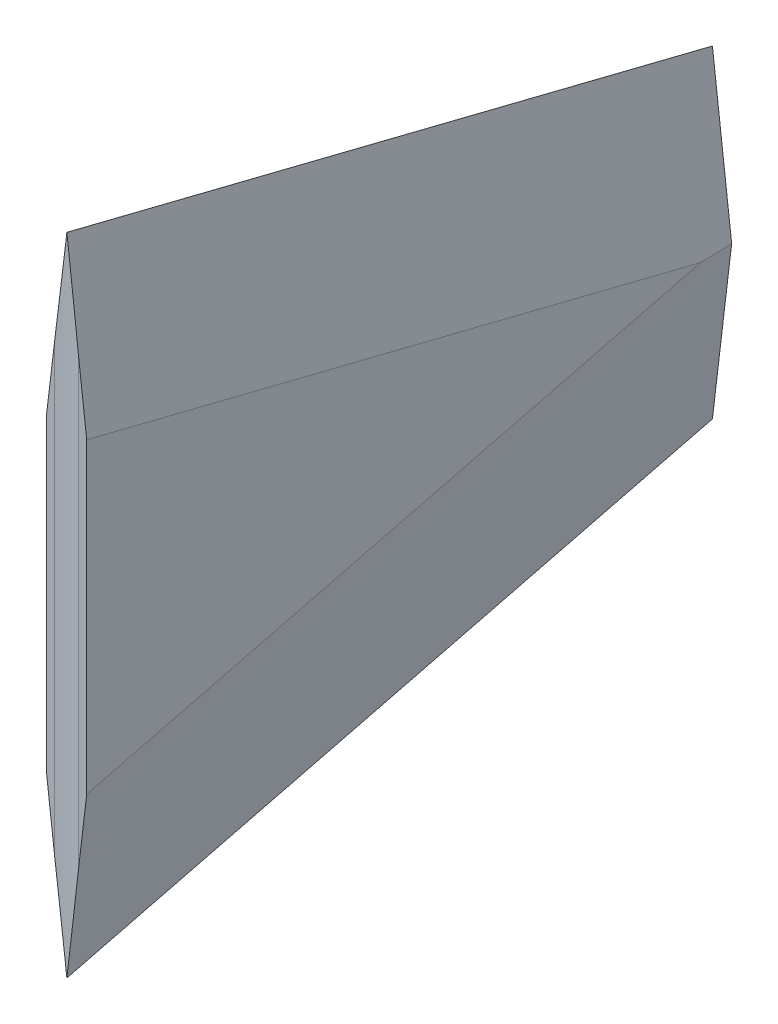
ISO-10303-21;
HEADER;
FILE_DESCRIPTION(('STEP AP214'),'2;1');
FILE_NAME('part.step','',(''),(''),'','','');
FILE_SCHEMA(('AUTOMOTIVE_DESIGN { 1 0 10303 214 1 1 1 1 }'));
ENDSEC;
DATA;
#1=APPLICATION_CONTEXT('core data for automotive mechanical design processes');
#2=APPLICATION_PROTOCOL_DEFINITION('international standard','automotive_design',2000,#1);
#3=PRODUCT_CONTEXT('',#1,'mechanical');
#4=PRODUCT('Part','Part','',(#3));
#5=PRODUCT_RELATED_PRODUCT_CATEGORY('part','',(#4));
#6=PRODUCT_DEFINITION_FORMATION('','',#4);
#7=PRODUCT_DEFINITION_CONTEXT('part definition',#1,'design');
#8=PRODUCT_DEFINITION('design','',#6,#7);
#9=PRODUCT_DEFINITION_SHAPE('','',#8);
#10=(LENGTH_UNIT() NAMED_UNIT(*) SI_UNIT(.MILLI.,.METRE.));
#11=(NAMED_UNIT(*) PLANE_ANGLE_UNIT() SI_UNIT($,.RADIAN.));
#12=(NAMED_UNIT(*) SI_UNIT($,.STERADIAN.) SOLID_ANGLE_UNIT());
#13=UNCERTAINTY_MEASURE_WITH_UNIT(LENGTH_MEASURE(1.E-05),#10,'distance_accuracy_value','');
#14=(GEOMETRIC_REPRESENTATION_CONTEXT(3) GLOBAL_UNCERTAINTY_ASSIGNED_CONTEXT((#13)) GLOBAL_UNIT_ASSIGNED_CONTEXT((#10,
#11,#12)) REPRESENTATION_CONTEXT('',''));
#15=CARTESIAN_POINT('',(0.,0.,0.));
#16=DIRECTION('',(0.,0.,1.));
#17=DIRECTION('',(1.,0.,0.));
#18=AXIS2_PLACEMENT_3D('',#15,#16,#17);
#19=CARTESIAN_POINT('',(6.35,0.,0.));
#20=DIRECTION('',(0.,0.,1.));
#21=DIRECTION('',(1.,0.,0.));
#22=AXIS2_PLACEMENT_3D('',#19,#20,#21);
#23=PLANE('',#22);
#24=DIRECTION('',(0.,1.,0.));
#25=VECTOR('',#24,1.);
#26=CARTESIAN_POINT('',(5.03527907583775,-25.4,0.));
#27=LINE('',#26,#25);
#28=CARTESIAN_POINT('',(5.03527907583788,-9.78295689131601,0.));
#29=VERTEX_POINT('',#28);
#30=CARTESIAN_POINT('',(5.03527907583775,60.5829568913172,0.));
#31=VERTEX_POINT('',#30);
#32=EDGE_CURVE('E97',#29,#31,#27,.T.);
#33=ORIENTED_EDGE('',*,*,#32,.F.);
#34=DIRECTION('',(0.118282309764434,0.992980007450699,0.));
#35=VECTOR('',#34,1.);
#36=CARTESIAN_POINT('',(6.202700496062,0.0175460990374543,0.));
#37=LINE('',#36,#35);
#38=CARTESIAN_POINT('',(6.35,1.25412545574038,0.));
#39=VERTEX_POINT('',#38);
#40=EDGE_CURVE('E41',#29,#39,#37,.T.);
#41=ORIENTED_EDGE('',*,*,#40,.T.);
#42=DIRECTION('',(0.,1.,0.));
#43=VECTOR('',#42,1.);
#44=CARTESIAN_POINT('',(6.35,0.,0.));
#45=LINE('',#44,#43);
#46=CARTESIAN_POINT('',(6.35,49.5458745442599,0.));
#47=VERTEX_POINT('',#46);
#48=EDGE_CURVE('E146',#39,#47,#45,.T.);
#49=ORIENTED_EDGE('',*,*,#48,.T.);
#50=DIRECTION('',(0.118282309764435,-0.992980007450699,0.));
#51=VECTOR('',#50,1.);
#52=CARTESIAN_POINT('',(12.1692605126857,0.693181704965604,0.));
#53=LINE('',#52,#51);
#54=EDGE_CURVE('E106',#47,#31,#53,.F.);
#55=ORIENTED_EDGE('',*,*,#54,.T.);
#56=EDGE_LOOP('',(#33,#41,#49,#55));
#57=FACE_BOUND('',#56,.T.);
#58=ADVANCED_FACE('F33',(#57),#23,.T.);
#59=DIRECTION('',(0.,1.,0.));
#60=VECTOR('',#59,1.);
#61=CARTESIAN_POINT('',(1.31472092416225,-25.4,0.));
#62=LINE('',#61,#60);
#63=CARTESIAN_POINT('',(1.31472092416226,60.5829568913173,0.));
#64=VERTEX_POINT('',#63);
#65=CARTESIAN_POINT('',(1.31472092416233,-9.78295689131778,0.));
#66=VERTEX_POINT('',#65);
#67=EDGE_CURVE('E108',#64,#66,#62,.F.);
#68=ORIENTED_EDGE('',*,*,#67,.F.);
#69=DIRECTION('',(-0.118282309764435,-0.992980007450699,0.));
#70=VECTOR('',#69,1.);
#71=CARTESIAN_POINT('',(-5.73041953718531,1.43900170704356,0.));
#72=LINE('',#71,#70);
#73=CARTESIAN_POINT('',(0.,49.5458745442598,0.));
#74=VERTEX_POINT('',#73);
#75=EDGE_CURVE('E136',#64,#74,#72,.T.);
#76=ORIENTED_EDGE('',*,*,#75,.T.);
#77=DIRECTION('',(0.,1.,0.));
#78=VECTOR('',#77,1.);
#79=CARTESIAN_POINT('',(0.,0.,0.));
#80=LINE('',#79,#78);
#81=CARTESIAN_POINT('',(0.,1.2541254557404,0.));
#82=VERTEX_POINT('',#81);
#83=EDGE_CURVE('E147',#82,#74,#80,.T.);
#84=ORIENTED_EDGE('',*,*,#83,.F.);
#85=DIRECTION('',(-0.118282309764434,0.992980007450699,0.));
#86=VECTOR('',#85,1.);
#87=CARTESIAN_POINT('',(0.236140479438385,-0.728273903040497,0.));
#88=LINE('',#87,#86);
#89=EDGE_CURVE('E119',#82,#66,#88,.F.);
#90=ORIENTED_EDGE('',*,*,#89,.T.);
#91=EDGE_LOOP('',(#68,#76,#84,#90));
#92=FACE_BOUND('',#91,.T.);
#93=ADVANCED_FACE('F165',(#92),#23,.T.);
#94=CARTESIAN_POINT('',(6.35,0.,-101.6));
#95=DIRECTION('',(0.,0.,1.));
#96=DIRECTION('',(1.,0.,0.));
#97=AXIS2_PLACEMENT_3D('',#94,#95,#96);
#98=PLANE('',#97);
#99=DIRECTION('',(-0.118282309764435,0.992980007450699,0.));
#100=VECTOR('',#99,1.);
#101=CARTESIAN_POINT('',(0.718181169625556,71.4249944336458,-101.6));
#102=LINE('',#101,#100);
#103=CARTESIAN_POINT('',(3.175,50.8,-101.6));
#104=VERTEX_POINT('',#103);
#105=CARTESIAN_POINT('',(6.20061043069722,25.4000000000004,-101.6));
#106=VERTEX_POINT('',#105);
#107=EDGE_CURVE('E134',#104,#106,#102,.F.);
#108=ORIENTED_EDGE('',*,*,#107,.T.);
#109=DIRECTION('',(-0.118282309764434,-0.992980007450699,0.));
#110=VECTOR('',#109,1.);
#111=CARTESIAN_POINT('',(3.35805531498596,1.53674939558291,-101.6));
#112=LINE('',#111,#110);
#113=CARTESIAN_POINT('',(3.175,0.,-101.6));
#114=VERTEX_POINT('',#113);
#115=EDGE_CURVE('E113',#106,#114,#112,.T.);
#116=ORIENTED_EDGE('',*,*,#115,.T.);
#117=DIRECTION('',(0.118282309764434,-0.992980007450699,0.));
#118=VECTOR('',#117,1.);
#119=CARTESIAN_POINT('',(5.98279294899935,-23.5714222098809,-101.6));
#120=LINE('',#119,#118);
#121=CARTESIAN_POINT('',(0.149389569302784,25.4000000000001,-101.6));
#122=VERTEX_POINT('',#121);
#123=EDGE_CURVE('E126',#114,#122,#120,.F.);
#124=ORIENTED_EDGE('',*,*,#123,.T.);
#125=DIRECTION('',(0.118282309764435,0.992980007450699,0.));
#126=VECTOR('',#125,1.);
#127=CARTESIAN_POINT('',(2.64097056638914,46.3168228281822,-101.6));
#128=LINE('',#127,#126);
#129=EDGE_CURVE('E141',#122,#104,#128,.T.);
#130=ORIENTED_EDGE('',*,*,#129,.T.);
#131=EDGE_LOOP('',(#108,#116,#124,#130));
#132=FACE_BOUND('',#131,.T.);
#133=ADVANCED_FACE('F175',(#132),#98,.F.);
#134=CARTESIAN_POINT('',(6.35,0.,0.));
#135=DIRECTION('',(1.,0.,0.));
#136=DIRECTION('',(0.,0.,-1.));
#137=AXIS2_PLACEMENT_3D('',#134,#135,#136);
#138=PLANE('',#137);
#139=ORIENTED_EDGE('',*,*,#48,.F.);
#140=DIRECTION('',(0.,0.242535625036333,-0.970142500145332));
#141=VECTOR('',#140,1.);
#142=CARTESIAN_POINT('',(6.35,25.0862357230498,-95.3284410692376));
#143=LINE('',#142,#141);
#144=CARTESIAN_POINT('',(6.35,25.4000000000001,-96.5834981770389));
#145=VERTEX_POINT('',#144);
#146=EDGE_CURVE('E112',#39,#145,#143,.T.);
#147=ORIENTED_EDGE('',*,*,#146,.T.);
#148=DIRECTION('',(0.,0.242535625036333,0.970142500145332));
#149=VECTOR('',#148,1.);
#150=CARTESIAN_POINT('',(6.35,46.631411335774,-11.6578528339435));
#151=LINE('',#150,#149);
#152=EDGE_CURVE('E131',#145,#47,#151,.T.);
#153=ORIENTED_EDGE('',*,*,#152,.T.);
#154=EDGE_LOOP('',(#139,#147,#153));
#155=FACE_BOUND('',#154,.T.);
#156=ADVANCED_FACE('F178',(#155),#138,.T.);
#157=CARTESIAN_POINT('',(0.,0.,0.));
#158=DIRECTION('',(1.,0.,0.));
#159=DIRECTION('',(0.,0.,-1.));
#160=AXIS2_PLACEMENT_3D('',#157,#158,#159);
#161=PLANE('',#160);
#162=DIRECTION('',(0.,-0.242535625036333,-0.970142500145332));
#163=VECTOR('',#162,1.);
#164=CARTESIAN_POINT('',(0.,25.7137642769504,-95.3284410692376));
#165=LINE('',#164,#163);
#166=CARTESIAN_POINT('',(0.,25.4000000000001,-96.5834981770389));
#167=VERTEX_POINT('',#166);
#168=EDGE_CURVE('E143',#74,#167,#165,.T.);
#169=ORIENTED_EDGE('',*,*,#168,.T.);
#170=DIRECTION('',(0.,-0.242535625036333,0.970142500145332));
#171=VECTOR('',#170,1.);
#172=CARTESIAN_POINT('',(0.,1.18035337010863,0.295088342527157));
#173=LINE('',#172,#171);
#174=EDGE_CURVE('E122',#167,#82,#173,.T.);
#175=ORIENTED_EDGE('',*,*,#174,.T.);
#176=ORIENTED_EDGE('',*,*,#83,.T.);
#177=EDGE_LOOP('',(#169,#175,#176));
#178=FACE_BOUND('',#177,.T.);
#179=ADVANCED_FACE('F168',(#178),#161,.F.);
#180=CARTESIAN_POINT('',(0.,46.631411335774,-11.6578528339435));
#181=DIRECTION('',(-0.992546151641322,0.118230629502141,-0.0295576573755352));
#182=DIRECTION('',(0.,0.242535625036333,0.970142500145332));
#183=AXIS2_PLACEMENT_3D('',#180,#181,#182);
#184=PLANE('',#183);
#185=CARTESIAN_POINT('',(3.175,84.709,34.036));
#186=DIRECTION('',(-0.992546151641322,0.118230629502141,-0.0295576573755352));
#187=DIRECTION('',(0.118178239324949,0.992986162163163,0.00351930426754921));
#188=AXIS2_PLACEMENT_3D('',#185,#186,#187);
#189=ELLIPSE('',#188,288.307692714964,34.0868);
#190=CARTESIAN_POINT('',(3.175,76.1873,-0.0508000000000002));
#191=VERTEX_POINT('',#190);
#192=EDGE_CURVE('E150',#191,#64,#189,.T.);
#193=ORIENTED_EDGE('',*,*,#192,.F.);
#194=DIRECTION('',(0.,0.242535625036333,0.970142500145332));
#195=VECTOR('',#194,1.);
#196=CARTESIAN_POINT('',(3.175,76.2,0.));
#197=LINE('',#196,#195);
#198=EDGE_CURVE('E138',#104,#191,#197,.T.);
#199=ORIENTED_EDGE('',*,*,#198,.F.);
#200=ORIENTED_EDGE('',*,*,#129,.F.);
#201=DIRECTION('',(0.0297664343188282,0.,-0.999556881516976));
#202=VECTOR('',#201,1.);
#203=CARTESIAN_POINT('',(-2.52681346996779,25.4000000000002,-11.7331004047226));
#204=LINE('',#203,#202);
#205=EDGE_CURVE('E124',#122,#167,#204,.F.);
#206=ORIENTED_EDGE('',*,*,#205,.T.);
#207=ORIENTED_EDGE('',*,*,#168,.F.);
#208=ORIENTED_EDGE('',*,*,#75,.F.);
#209=EDGE_LOOP('',(#193,#199,#200,#206,#207,#208));
#210=FACE_BOUND('',#209,.T.);
#211=ADVANCED_FACE('F170',(#210),#184,.T.);
#212=CARTESIAN_POINT('',(3.17500000000001,71.7176470588235,-17.9294117647059));
#213=DIRECTION('',(-0.992546151641322,-0.118230629502141,0.0295576573755352));
#214=DIRECTION('',(0.,-0.242535625036333,-0.970142500145332));
#215=AXIS2_PLACEMENT_3D('',#212,#213,#214);
#216=PLANE('',#215);
#217=CARTESIAN_POINT('',(3.175,84.709,34.036));
#218=DIRECTION('',(-0.992546151641322,-0.118230629502141,0.0295576573755352));
#219=DIRECTION('',(-0.118178239324949,0.992986162163163,0.0035193042675492));
#220=AXIS2_PLACEMENT_3D('',#217,#218,#219);
#221=ELLIPSE('',#220,288.307692714964,34.0868);
#222=EDGE_CURVE('E107',#31,#191,#221,.F.);
#223=ORIENTED_EDGE('',*,*,#222,.F.);
#224=ORIENTED_EDGE('',*,*,#54,.F.);
#225=ORIENTED_EDGE('',*,*,#152,.F.);
#226=DIRECTION('',(0.0297664343188282,0.,0.999556881516977));
#227=VECTOR('',#226,1.);
#228=CARTESIAN_POINT('',(8.68740106625647,25.4000000000002,-18.093569030102));
#229=LINE('',#228,#227);
#230=EDGE_CURVE('E55',#145,#106,#229,.F.);
#231=ORIENTED_EDGE('',*,*,#230,.T.);
#232=ORIENTED_EDGE('',*,*,#107,.F.);
#233=ORIENTED_EDGE('',*,*,#198,.T.);
#234=EDGE_LOOP('',(#223,#224,#225,#231,#232,#233));
#235=FACE_BOUND('',#234,.T.);
#236=ADVANCED_FACE('F179',(#235),#216,.F.);
#237=CARTESIAN_POINT('',(3.175,-23.9058823529412,-5.97647058823529));
#238=DIRECTION('',(0.992546151641322,0.11823062950214,0.0295576573755349));
#239=DIRECTION('',(0.,0.242535625036333,-0.970142500145332));
#240=AXIS2_PLACEMENT_3D('',#237,#238,#239);
#241=PLANE('',#240);
#242=CARTESIAN_POINT('',(3.175,-33.909,34.036));
#243=DIRECTION('',(0.992546151641322,0.11823062950214,0.0295576573755349));
#244=DIRECTION('',(-0.118178239324948,0.992986162163163,-0.00351930426754914));
#245=AXIS2_PLACEMENT_3D('',#242,#243,#244);
#246=ELLIPSE('',#245,288.307692714967,34.0868);
#247=CARTESIAN_POINT('',(3.175,-25.3873,-0.0508000000000088));
#248=VERTEX_POINT('',#247);
#249=EDGE_CURVE('E47',#66,#248,#246,.F.);
#250=ORIENTED_EDGE('',*,*,#249,.F.);
#251=ORIENTED_EDGE('',*,*,#89,.F.);
#252=ORIENTED_EDGE('',*,*,#174,.F.);
#253=ORIENTED_EDGE('',*,*,#205,.F.);
#254=ORIENTED_EDGE('',*,*,#123,.F.);
#255=DIRECTION('',(0.,0.242535625036333,-0.970142500145332));
#256=VECTOR('',#255,1.);
#257=CARTESIAN_POINT('',(3.175,-23.9058823529412,-5.97647058823529));
#258=LINE('',#257,#256);
#259=EDGE_CURVE('E128',#248,#114,#258,.T.);
#260=ORIENTED_EDGE('',*,*,#259,.F.);
#261=EDGE_LOOP('',(#250,#251,#252,#253,#254,#260));
#262=FACE_BOUND('',#261,.T.);
#263=ADVANCED_FACE('F161',(#262),#241,.F.);
#264=CARTESIAN_POINT('',(6.35,1.1803533701086,0.295088342527149));
#265=DIRECTION('',(0.992546151641322,-0.11823062950214,-0.029557657375535));
#266=DIRECTION('',(0.,-0.242535625036333,0.970142500145332));
#267=AXIS2_PLACEMENT_3D('',#264,#265,#266);
#268=PLANE('',#267);
#269=CARTESIAN_POINT('',(3.175,-33.909,34.036));
#270=DIRECTION('',(0.992546151641322,-0.11823062950214,-0.029557657375535));
#271=DIRECTION('',(0.118178239324948,0.992986162163163,-0.00351930426754914));
#272=AXIS2_PLACEMENT_3D('',#269,#270,#271);
#273=ELLIPSE('',#272,288.307692714967,34.0868);
#274=EDGE_CURVE('E11',#248,#29,#273,.T.);
#275=ORIENTED_EDGE('',*,*,#274,.F.);
#276=ORIENTED_EDGE('',*,*,#259,.T.);
#277=ORIENTED_EDGE('',*,*,#115,.F.);
#278=ORIENTED_EDGE('',*,*,#230,.F.);
#279=ORIENTED_EDGE('',*,*,#146,.F.);
#280=ORIENTED_EDGE('',*,*,#40,.F.);
#281=EDGE_LOOP('',(#275,#276,#277,#278,#279,#280));
#282=FACE_BOUND('',#281,.T.);
#283=ADVANCED_FACE('F35',(#282),#268,.T.);
#284=CARTESIAN_POINT('',(3.175,-25.4,34.036));
#285=DIRECTION('',(0.,1.,0.));
#286=DIRECTION('',(0.,0.,1.));
#287=AXIS2_PLACEMENT_3D('',#284,#285,#286);
#288=CYLINDRICAL_SURFACE('',#287,34.0868);
#289=ORIENTED_EDGE('',*,*,#192,.T.);
#290=ORIENTED_EDGE('',*,*,#67,.T.);
#291=ORIENTED_EDGE('',*,*,#249,.T.);
#292=ORIENTED_EDGE('',*,*,#274,.T.);
#293=ORIENTED_EDGE('',*,*,#32,.T.);
#294=ORIENTED_EDGE('',*,*,#222,.T.);
#295=EDGE_LOOP('',(#289,#290,#291,#292,#293,#294));
#296=FACE_BOUND('',#295,.T.);
#297=ADVANCED_FACE('F96',(#296),#288,.F.);
#298=CLOSED_SHELL('',(#58,#93,#133,#156,#179,#211,#236,#263,#283,#297));
#299=MANIFOLD_SOLID_BREP('B2',#298);
#300=ADVANCED_BREP_SHAPE_REPRESENTATION('',(#18,#299),#14);
#301=SHAPE_DEFINITION_REPRESENTATION(#9,#300);
ENDSEC;
END-ISO-10303-21;
